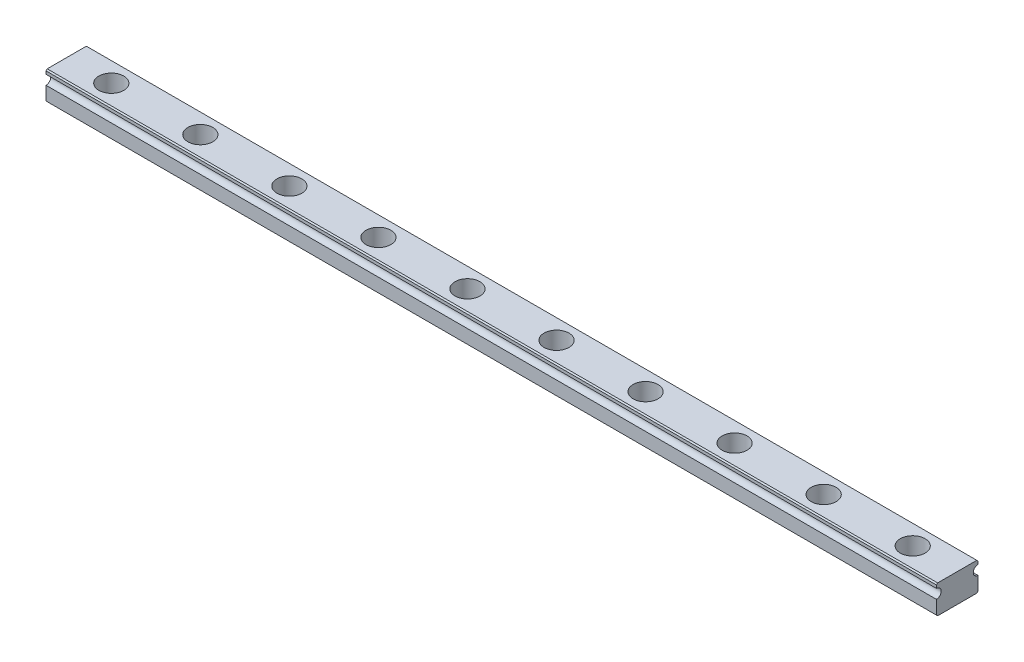
ISO-10303-21;
HEADER;
FILE_DESCRIPTION(('STEP AP214'),'2;1');
FILE_NAME('part.step','',(''),(''),'','','');
FILE_SCHEMA(('AUTOMOTIVE_DESIGN { 1 0 10303 214 1 1 1 1 }'));
ENDSEC;
DATA;
#1=APPLICATION_CONTEXT('core data for automotive mechanical design processes');
#2=APPLICATION_PROTOCOL_DEFINITION('international standard','automotive_design',2000,#1);
#3=PRODUCT_CONTEXT('',#1,'mechanical');
#4=PRODUCT('Part','Part','',(#3));
#5=PRODUCT_RELATED_PRODUCT_CATEGORY('part','',(#4));
#6=PRODUCT_DEFINITION_FORMATION('','',#4);
#7=PRODUCT_DEFINITION_CONTEXT('part definition',#1,'design');
#8=PRODUCT_DEFINITION('design','',#6,#7);
#9=PRODUCT_DEFINITION_SHAPE('','',#8);
#10=(LENGTH_UNIT() NAMED_UNIT(*) SI_UNIT(.MILLI.,.METRE.));
#11=(NAMED_UNIT(*) PLANE_ANGLE_UNIT() SI_UNIT($,.RADIAN.));
#12=(NAMED_UNIT(*) SI_UNIT($,.STERADIAN.) SOLID_ANGLE_UNIT());
#13=UNCERTAINTY_MEASURE_WITH_UNIT(LENGTH_MEASURE(1.E-05),#10,'distance_accuracy_value','');
#14=(GEOMETRIC_REPRESENTATION_CONTEXT(3) GLOBAL_UNCERTAINTY_ASSIGNED_CONTEXT((#13)) GLOBAL_UNIT_ASSIGNED_CONTEXT((#10,
#11,#12)) REPRESENTATION_CONTEXT('',''));
#15=CARTESIAN_POINT('',(0.,0.,0.));
#16=DIRECTION('',(0.,0.,1.));
#17=DIRECTION('',(1.,0.,0.));
#18=AXIS2_PLACEMENT_3D('',#15,#16,#17);
#19=CARTESIAN_POINT('',(75.,0.,-3.5));
#20=DIRECTION('',(0.,0.,1.));
#21=DIRECTION('',(1.,0.,0.));
#22=AXIS2_PLACEMENT_3D('',#19,#20,#21);
#23=PLANE('',#22);
#24=DIRECTION('',(0.,1.,0.));
#25=VECTOR('',#24,1.);
#26=CARTESIAN_POINT('',(75.,0.,-3.5));
#27=LINE('',#26,#25);
#28=CARTESIAN_POINT('',(75.,0.199999999999992,-3.5));
#29=VERTEX_POINT('',#28);
#30=CARTESIAN_POINT('',(75.,2.5,-3.5));
#31=VERTEX_POINT('',#30);
#32=EDGE_CURVE('E128',#29,#31,#27,.T.);
#33=ORIENTED_EDGE('',*,*,#32,.F.);
#34=DIRECTION('',(-1.,0.,0.));
#35=VECTOR('',#34,1.);
#36=CARTESIAN_POINT('',(75.,0.199999999999992,-3.5));
#37=LINE('',#36,#35);
#38=CARTESIAN_POINT('',(-75.,0.199999999999992,-3.5));
#39=VERTEX_POINT('',#38);
#40=EDGE_CURVE('E180',#29,#39,#37,.T.);
#41=ORIENTED_EDGE('',*,*,#40,.T.);
#42=DIRECTION('',(0.,1.,0.));
#43=VECTOR('',#42,1.);
#44=CARTESIAN_POINT('',(-75.,0.,-3.5));
#45=LINE('',#44,#43);
#46=CARTESIAN_POINT('',(-75.,2.5,-3.5));
#47=VERTEX_POINT('',#46);
#48=EDGE_CURVE('E152',#39,#47,#45,.T.);
#49=ORIENTED_EDGE('',*,*,#48,.T.);
#50=DIRECTION('',(-1.,0.,0.));
#51=VECTOR('',#50,1.);
#52=CARTESIAN_POINT('',(75.,2.5,-3.5));
#53=LINE('',#52,#51);
#54=EDGE_CURVE('E145',#31,#47,#53,.T.);
#55=ORIENTED_EDGE('',*,*,#54,.F.);
#56=EDGE_LOOP('',(#33,#41,#49,#55));
#57=FACE_BOUND('',#56,.T.);
#58=ADVANCED_FACE('F36',(#57),#23,.F.);
#59=CARTESIAN_POINT('',(75.,3.3,-3.5));
#60=DIRECTION('',(-1.,0.,0.));
#61=DIRECTION('',(0.,0.,1.));
#62=AXIS2_PLACEMENT_3D('',#59,#60,#61);
#63=CYLINDRICAL_SURFACE('',#62,0.8);
#64=CARTESIAN_POINT('',(-75.,3.3,-3.5));
#65=DIRECTION('',(-1.,0.,0.));
#66=DIRECTION('',(0.,0.,1.));
#67=AXIS2_PLACEMENT_3D('',#64,#65,#66);
#68=CIRCLE('',#67,0.8);
#69=CARTESIAN_POINT('',(-75.,4.1,-3.5));
#70=VERTEX_POINT('',#69);
#71=EDGE_CURVE('E218',#47,#70,#68,.T.);
#72=ORIENTED_EDGE('',*,*,#71,.T.);
#73=DIRECTION('',(-1.,0.,0.));
#74=VECTOR('',#73,1.);
#75=CARTESIAN_POINT('',(75.,4.1,-3.5));
#76=LINE('',#75,#74);
#77=CARTESIAN_POINT('',(75.,4.1,-3.5));
#78=VERTEX_POINT('',#77);
#79=EDGE_CURVE('E147',#78,#70,#76,.T.);
#80=ORIENTED_EDGE('',*,*,#79,.F.);
#81=CARTESIAN_POINT('',(75.,3.3,-3.5));
#82=DIRECTION('',(-1.,0.,0.));
#83=DIRECTION('',(0.,0.,1.));
#84=AXIS2_PLACEMENT_3D('',#81,#82,#83);
#85=CIRCLE('',#84,0.8);
#86=EDGE_CURVE('E132',#31,#78,#85,.T.);
#87=ORIENTED_EDGE('',*,*,#86,.F.);
#88=ORIENTED_EDGE('',*,*,#54,.T.);
#89=EDGE_LOOP('',(#72,#80,#87,#88));
#90=FACE_BOUND('',#89,.T.);
#91=ADVANCED_FACE('F144',(#90),#63,.F.);
#92=CARTESIAN_POINT('',(75.,4.1,-3.5));
#93=DIRECTION('',(0.,0.,1.));
#94=DIRECTION('',(1.,0.,0.));
#95=AXIS2_PLACEMENT_3D('',#92,#93,#94);
#96=PLANE('',#95);
#97=DIRECTION('',(0.,1.,0.));
#98=VECTOR('',#97,1.);
#99=CARTESIAN_POINT('',(-75.,4.1,-3.5));
#100=LINE('',#99,#98);
#101=CARTESIAN_POINT('',(-75.,4.60000000000001,-3.5));
#102=VERTEX_POINT('',#101);
#103=EDGE_CURVE('E220',#70,#102,#100,.T.);
#104=ORIENTED_EDGE('',*,*,#103,.T.);
#105=DIRECTION('',(1.,0.,0.));
#106=VECTOR('',#105,1.);
#107=CARTESIAN_POINT('',(75.,4.60000000000001,-3.5));
#108=LINE('',#107,#106);
#109=CARTESIAN_POINT('',(75.,4.60000000000001,-3.5));
#110=VERTEX_POINT('',#109);
#111=EDGE_CURVE('E172',#102,#110,#108,.T.);
#112=ORIENTED_EDGE('',*,*,#111,.T.);
#113=DIRECTION('',(0.,1.,0.));
#114=VECTOR('',#113,1.);
#115=CARTESIAN_POINT('',(75.,4.1,-3.5));
#116=LINE('',#115,#114);
#117=EDGE_CURVE('E149',#78,#110,#116,.T.);
#118=ORIENTED_EDGE('',*,*,#117,.F.);
#119=ORIENTED_EDGE('',*,*,#79,.T.);
#120=EDGE_LOOP('',(#104,#112,#118,#119));
#121=FACE_BOUND('',#120,.T.);
#122=ADVANCED_FACE('F282',(#121),#96,.F.);
#123=CARTESIAN_POINT('',(75.,4.8,-3.5));
#124=DIRECTION('',(0.,-1.,0.));
#125=DIRECTION('',(0.,0.,-1.));
#126=AXIS2_PLACEMENT_3D('',#123,#124,#125);
#127=PLANE('',#126);
#128=CARTESIAN_POINT('',(-67.5,4.8,1.24498369098229E-12));
#129=DIRECTION('',(0.,1.,0.));
#130=DIRECTION('',(0.,0.,1.));
#131=AXIS2_PLACEMENT_3D('',#128,#129,#130);
#132=CIRCLE('',#131,2.10000000000002);
#133=CARTESIAN_POINT('',(-67.5,4.8,2.10000000000126));
#134=VERTEX_POINT('',#133);
#135=EDGE_CURVE('E375',#134,#134,#132,.T.);
#136=ORIENTED_EDGE('',*,*,#135,.F.);
#137=EDGE_LOOP('',(#136));
#138=FACE_BOUND('',#137,.T.);
#139=CARTESIAN_POINT('',(52.5,4.8,9.33737768236719E-13));
#140=DIRECTION('',(0.,1.,0.));
#141=DIRECTION('',(0.,0.,-1.));
#142=AXIS2_PLACEMENT_3D('',#139,#140,#141);
#143=CIRCLE('',#142,2.1);
#144=CARTESIAN_POINT('',(52.5,4.8,-2.09999999999907));
#145=VERTEX_POINT('',#144);
#146=EDGE_CURVE('E373',#145,#145,#143,.T.);
#147=ORIENTED_EDGE('',*,*,#146,.F.);
#148=EDGE_LOOP('',(#147));
#149=FACE_BOUND('',#148,.T.);
#150=CARTESIAN_POINT('',(37.5,4.8,6.22491845491146E-13));
#151=DIRECTION('',(0.,1.,0.));
#152=DIRECTION('',(0.,0.,-1.));
#153=AXIS2_PLACEMENT_3D('',#150,#151,#152);
#154=CIRCLE('',#153,2.1);
#155=CARTESIAN_POINT('',(37.5,4.8,-2.09999999999937));
#156=VERTEX_POINT('',#155);
#157=EDGE_CURVE('E369',#156,#156,#154,.T.);
#158=ORIENTED_EDGE('',*,*,#157,.F.);
#159=EDGE_LOOP('',(#158));
#160=FACE_BOUND('',#159,.T.);
#161=CARTESIAN_POINT('',(22.5,4.8,3.11245922745573E-13));
#162=DIRECTION('',(0.,1.,0.));
#163=DIRECTION('',(0.,0.,-1.));
#164=AXIS2_PLACEMENT_3D('',#161,#162,#163);
#165=CIRCLE('',#164,2.1);
#166=CARTESIAN_POINT('',(22.5,4.8,-2.09999999999969));
#167=VERTEX_POINT('',#166);
#168=EDGE_CURVE('E366',#167,#167,#165,.T.);
#169=ORIENTED_EDGE('',*,*,#168,.F.);
#170=EDGE_LOOP('',(#169));
#171=FACE_BOUND('',#170,.T.);
#172=CARTESIAN_POINT('',(-52.5,4.8,9.33737768236719E-13));
#173=DIRECTION('',(0.,1.,0.));
#174=DIRECTION('',(0.,0.,1.));
#175=AXIS2_PLACEMENT_3D('',#172,#173,#174);
#176=CIRCLE('',#175,2.1);
#177=CARTESIAN_POINT('',(-52.5,4.8,2.10000000000094));
#178=VERTEX_POINT('',#177);
#179=EDGE_CURVE('E378',#178,#178,#176,.T.);
#180=ORIENTED_EDGE('',*,*,#179,.F.);
#181=EDGE_LOOP('',(#180));
#182=FACE_BOUND('',#181,.T.);
#183=CARTESIAN_POINT('',(-37.5,4.8,6.22491845491146E-13));
#184=DIRECTION('',(0.,1.,0.));
#185=DIRECTION('',(0.,0.,1.));
#186=AXIS2_PLACEMENT_3D('',#183,#184,#185);
#187=CIRCLE('',#186,2.1);
#188=CARTESIAN_POINT('',(-37.5,4.8,2.10000000000062));
#189=VERTEX_POINT('',#188);
#190=EDGE_CURVE('E387',#189,#189,#187,.T.);
#191=ORIENTED_EDGE('',*,*,#190,.F.);
#192=EDGE_LOOP('',(#191));
#193=FACE_BOUND('',#192,.T.);
#194=CARTESIAN_POINT('',(-22.5,4.8,3.11245922745573E-13));
#195=DIRECTION('',(0.,1.,0.));
#196=DIRECTION('',(0.,0.,1.));
#197=AXIS2_PLACEMENT_3D('',#194,#195,#196);
#198=CIRCLE('',#197,2.1);
#199=CARTESIAN_POINT('',(-22.5,4.8,2.10000000000031));
#200=VERTEX_POINT('',#199);
#201=EDGE_CURVE('E384',#200,#200,#198,.T.);
#202=ORIENTED_EDGE('',*,*,#201,.F.);
#203=EDGE_LOOP('',(#202));
#204=FACE_BOUND('',#203,.T.);
#205=CARTESIAN_POINT('',(67.5,4.8,1.24498369098229E-12));
#206=DIRECTION('',(0.,1.,0.));
#207=DIRECTION('',(0.,0.,-1.));
#208=AXIS2_PLACEMENT_3D('',#205,#206,#207);
#209=CIRCLE('',#208,2.10000000000002);
#210=CARTESIAN_POINT('',(67.5,4.8,-2.09999999999877));
#211=VERTEX_POINT('',#210);
#212=EDGE_CURVE('E381',#211,#211,#209,.T.);
#213=ORIENTED_EDGE('',*,*,#212,.F.);
#214=EDGE_LOOP('',(#213));
#215=FACE_BOUND('',#214,.T.);
#216=CARTESIAN_POINT('',(7.5,4.8,0.));
#217=DIRECTION('',(0.,1.,0.));
#218=DIRECTION('',(0.,0.,-1.));
#219=AXIS2_PLACEMENT_3D('',#216,#217,#218);
#220=CIRCLE('',#219,2.1);
#221=CARTESIAN_POINT('',(7.5,4.8,-2.1));
#222=VERTEX_POINT('',#221);
#223=EDGE_CURVE('E359',#222,#222,#220,.T.);
#224=ORIENTED_EDGE('',*,*,#223,.F.);
#225=EDGE_LOOP('',(#224));
#226=FACE_BOUND('',#225,.T.);
#227=CARTESIAN_POINT('',(-7.5,4.8,0.));
#228=DIRECTION('',(0.,1.,0.));
#229=DIRECTION('',(0.,0.,1.));
#230=AXIS2_PLACEMENT_3D('',#227,#228,#229);
#231=CIRCLE('',#230,2.1);
#232=CARTESIAN_POINT('',(-7.5,4.8,2.1));
#233=VERTEX_POINT('',#232);
#234=EDGE_CURVE('E191',#233,#233,#231,.T.);
#235=ORIENTED_EDGE('',*,*,#234,.F.);
#236=EDGE_LOOP('',(#235));
#237=FACE_BOUND('',#236,.T.);
#238=DIRECTION('',(0.,0.,1.));
#239=VECTOR('',#238,1.);
#240=CARTESIAN_POINT('',(75.,4.8,-3.5));
#241=LINE('',#240,#239);
#242=CARTESIAN_POINT('',(75.,4.8,-3.30000000000001));
#243=VERTEX_POINT('',#242);
#244=CARTESIAN_POINT('',(75.,4.8,3.29999999999999));
#245=VERTEX_POINT('',#244);
#246=EDGE_CURVE('E395',#243,#245,#241,.T.);
#247=ORIENTED_EDGE('',*,*,#246,.F.);
#248=DIRECTION('',(-1.,0.,0.));
#249=VECTOR('',#248,1.);
#250=CARTESIAN_POINT('',(75.,4.8,-3.30000000000001));
#251=LINE('',#250,#249);
#252=CARTESIAN_POINT('',(-75.,4.8,-3.30000000000001));
#253=VERTEX_POINT('',#252);
#254=EDGE_CURVE('E156',#243,#253,#251,.T.);
#255=ORIENTED_EDGE('',*,*,#254,.T.);
#256=DIRECTION('',(0.,0.,1.));
#257=VECTOR('',#256,1.);
#258=CARTESIAN_POINT('',(-75.,4.8,-3.5));
#259=LINE('',#258,#257);
#260=CARTESIAN_POINT('',(-75.,4.8,3.29999999999999));
#261=VERTEX_POINT('',#260);
#262=EDGE_CURVE('E228',#253,#261,#259,.T.);
#263=ORIENTED_EDGE('',*,*,#262,.T.);
#264=DIRECTION('',(1.,0.,0.));
#265=VECTOR('',#264,1.);
#266=CARTESIAN_POINT('',(75.,4.8,3.29999999999999));
#267=LINE('',#266,#265);
#268=EDGE_CURVE('E154',#261,#245,#267,.T.);
#269=ORIENTED_EDGE('',*,*,#268,.T.);
#270=EDGE_LOOP('',(#247,#255,#263,#269));
#271=FACE_BOUND('',#270,.T.);
#272=ADVANCED_FACE('F297',(#138,#149,#160,#171,#182,#193,#204,#215,#226,#237,#271),#127,.F.);
#273=CARTESIAN_POINT('',(75.,4.1,3.5));
#274=DIRECTION('',(0.,0.,-1.));
#275=DIRECTION('',(-1.,0.,0.));
#276=AXIS2_PLACEMENT_3D('',#273,#274,#275);
#277=PLANE('',#276);
#278=DIRECTION('',(0.,-1.,0.));
#279=VECTOR('',#278,1.);
#280=CARTESIAN_POINT('',(75.,4.1,3.5));
#281=LINE('',#280,#279);
#282=CARTESIAN_POINT('',(75.,4.59999999999999,3.5));
#283=VERTEX_POINT('',#282);
#284=CARTESIAN_POINT('',(75.,4.1,3.5));
#285=VERTEX_POINT('',#284);
#286=EDGE_CURVE('E398',#283,#285,#281,.T.);
#287=ORIENTED_EDGE('',*,*,#286,.F.);
#288=DIRECTION('',(-1.,0.,0.));
#289=VECTOR('',#288,1.);
#290=CARTESIAN_POINT('',(75.,4.59999999999999,3.5));
#291=LINE('',#290,#289);
#292=CARTESIAN_POINT('',(-75.,4.59999999999999,3.5));
#293=VERTEX_POINT('',#292);
#294=EDGE_CURVE('E11',#283,#293,#291,.T.);
#295=ORIENTED_EDGE('',*,*,#294,.T.);
#296=DIRECTION('',(0.,-1.,0.));
#297=VECTOR('',#296,1.);
#298=CARTESIAN_POINT('',(-75.,4.1,3.5));
#299=LINE('',#298,#297);
#300=CARTESIAN_POINT('',(-75.,4.1,3.5));
#301=VERTEX_POINT('',#300);
#302=EDGE_CURVE('E231',#293,#301,#299,.T.);
#303=ORIENTED_EDGE('',*,*,#302,.T.);
#304=DIRECTION('',(-1.,0.,0.));
#305=VECTOR('',#304,1.);
#306=CARTESIAN_POINT('',(75.,4.1,3.5));
#307=LINE('',#306,#305);
#308=EDGE_CURVE('E158',#285,#301,#307,.T.);
#309=ORIENTED_EDGE('',*,*,#308,.F.);
#310=EDGE_LOOP('',(#287,#295,#303,#309));
#311=FACE_BOUND('',#310,.T.);
#312=ADVANCED_FACE('F301',(#311),#277,.F.);
#313=CARTESIAN_POINT('',(75.,3.3,3.5));
#314=DIRECTION('',(-1.,0.,0.));
#315=DIRECTION('',(0.,0.,1.));
#316=AXIS2_PLACEMENT_3D('',#313,#314,#315);
#317=CYLINDRICAL_SURFACE('',#316,0.8);
#318=CARTESIAN_POINT('',(-75.,3.3,3.5));
#319=DIRECTION('',(-1.,0.,0.));
#320=DIRECTION('',(0.,0.,-1.));
#321=AXIS2_PLACEMENT_3D('',#318,#319,#320);
#322=CIRCLE('',#321,0.8);
#323=CARTESIAN_POINT('',(-75.,2.5,3.5));
#324=VERTEX_POINT('',#323);
#325=EDGE_CURVE('E233',#301,#324,#322,.T.);
#326=ORIENTED_EDGE('',*,*,#325,.T.);
#327=DIRECTION('',(-1.,0.,0.));
#328=VECTOR('',#327,1.);
#329=CARTESIAN_POINT('',(75.,2.5,3.5));
#330=LINE('',#329,#328);
#331=CARTESIAN_POINT('',(75.,2.5,3.5));
#332=VERTEX_POINT('',#331);
#333=EDGE_CURVE('E239',#332,#324,#330,.T.);
#334=ORIENTED_EDGE('',*,*,#333,.F.);
#335=CARTESIAN_POINT('',(75.,3.3,3.5));
#336=DIRECTION('',(-1.,0.,0.));
#337=DIRECTION('',(0.,0.,-1.));
#338=AXIS2_PLACEMENT_3D('',#335,#336,#337);
#339=CIRCLE('',#338,0.8);
#340=EDGE_CURVE('E248',#285,#332,#339,.T.);
#341=ORIENTED_EDGE('',*,*,#340,.F.);
#342=ORIENTED_EDGE('',*,*,#308,.T.);
#343=EDGE_LOOP('',(#326,#334,#341,#342));
#344=FACE_BOUND('',#343,.T.);
#345=ADVANCED_FACE('F246',(#344),#317,.F.);
#346=CARTESIAN_POINT('',(75.,0.,3.5));
#347=DIRECTION('',(0.,0.,-1.));
#348=DIRECTION('',(-1.,0.,0.));
#349=AXIS2_PLACEMENT_3D('',#346,#347,#348);
#350=PLANE('',#349);
#351=DIRECTION('',(0.,-1.,0.));
#352=VECTOR('',#351,1.);
#353=CARTESIAN_POINT('',(-75.,0.,3.5));
#354=LINE('',#353,#352);
#355=CARTESIAN_POINT('',(-75.,0.200000000000006,3.5));
#356=VERTEX_POINT('',#355);
#357=EDGE_CURVE('E235',#324,#356,#354,.T.);
#358=ORIENTED_EDGE('',*,*,#357,.T.);
#359=DIRECTION('',(1.,0.,0.));
#360=VECTOR('',#359,1.);
#361=CARTESIAN_POINT('',(75.,0.200000000000006,3.5));
#362=LINE('',#361,#360);
#363=CARTESIAN_POINT('',(75.,0.200000000000006,3.5));
#364=VERTEX_POINT('',#363);
#365=EDGE_CURVE('E46',#356,#364,#362,.T.);
#366=ORIENTED_EDGE('',*,*,#365,.T.);
#367=DIRECTION('',(0.,-1.,0.));
#368=VECTOR('',#367,1.);
#369=CARTESIAN_POINT('',(75.,0.,3.5));
#370=LINE('',#369,#368);
#371=EDGE_CURVE('E400',#332,#364,#370,.T.);
#372=ORIENTED_EDGE('',*,*,#371,.F.);
#373=ORIENTED_EDGE('',*,*,#333,.T.);
#374=EDGE_LOOP('',(#358,#366,#372,#373));
#375=FACE_BOUND('',#374,.T.);
#376=ADVANCED_FACE('F259',(#375),#350,.F.);
#377=CARTESIAN_POINT('',(75.,0.,3.5));
#378=DIRECTION('',(0.,1.,0.));
#379=DIRECTION('',(0.,0.,1.));
#380=AXIS2_PLACEMENT_3D('',#377,#378,#379);
#381=PLANE('',#380);
#382=CARTESIAN_POINT('',(-67.5,0.,1.24498369098229E-12));
#383=DIRECTION('',(0.,1.,0.));
#384=DIRECTION('',(0.,0.,1.));
#385=AXIS2_PLACEMENT_3D('',#382,#383,#384);
#386=CIRCLE('',#385,2.10000000000002);
#387=CARTESIAN_POINT('',(-67.5,0.,2.10000000000126));
#388=VERTEX_POINT('',#387);
#389=EDGE_CURVE('E41',#388,#388,#386,.T.);
#390=ORIENTED_EDGE('',*,*,#389,.T.);
#391=EDGE_LOOP('',(#390));
#392=FACE_BOUND('',#391,.T.);
#393=CARTESIAN_POINT('',(52.5,0.,9.33737768236719E-13));
#394=DIRECTION('',(0.,1.,0.));
#395=DIRECTION('',(0.,0.,1.));
#396=AXIS2_PLACEMENT_3D('',#393,#394,#395);
#397=CIRCLE('',#396,2.1);
#398=CARTESIAN_POINT('',(52.5,0.,2.10000000000094));
#399=VERTEX_POINT('',#398);
#400=EDGE_CURVE('E211',#399,#399,#397,.T.);
#401=ORIENTED_EDGE('',*,*,#400,.T.);
#402=EDGE_LOOP('',(#401));
#403=FACE_BOUND('',#402,.T.);
#404=CARTESIAN_POINT('',(37.5,0.,6.22491845491146E-13));
#405=DIRECTION('',(0.,1.,0.));
#406=DIRECTION('',(0.,0.,1.));
#407=AXIS2_PLACEMENT_3D('',#404,#405,#406);
#408=CIRCLE('',#407,2.1);
#409=CARTESIAN_POINT('',(37.5,0.,2.10000000000062));
#410=VERTEX_POINT('',#409);
#411=EDGE_CURVE('E209',#410,#410,#408,.T.);
#412=ORIENTED_EDGE('',*,*,#411,.T.);
#413=EDGE_LOOP('',(#412));
#414=FACE_BOUND('',#413,.T.);
#415=CARTESIAN_POINT('',(22.5,0.,3.11245922745573E-13));
#416=DIRECTION('',(0.,1.,0.));
#417=DIRECTION('',(0.,0.,1.));
#418=AXIS2_PLACEMENT_3D('',#415,#416,#417);
#419=CIRCLE('',#418,2.1);
#420=CARTESIAN_POINT('',(22.5,0.,2.10000000000031));
#421=VERTEX_POINT('',#420);
#422=EDGE_CURVE('E206',#421,#421,#419,.T.);
#423=ORIENTED_EDGE('',*,*,#422,.T.);
#424=EDGE_LOOP('',(#423));
#425=FACE_BOUND('',#424,.T.);
#426=CARTESIAN_POINT('',(-52.5,0.,9.33737768236719E-13));
#427=DIRECTION('',(0.,1.,0.));
#428=DIRECTION('',(0.,0.,1.));
#429=AXIS2_PLACEMENT_3D('',#426,#427,#428);
#430=CIRCLE('',#429,2.1);
#431=CARTESIAN_POINT('',(-52.5,0.,2.10000000000094));
#432=VERTEX_POINT('',#431);
#433=EDGE_CURVE('E203',#432,#432,#430,.T.);
#434=ORIENTED_EDGE('',*,*,#433,.T.);
#435=EDGE_LOOP('',(#434));
#436=FACE_BOUND('',#435,.T.);
#437=CARTESIAN_POINT('',(-37.5,0.,6.22491845491146E-13));
#438=DIRECTION('',(0.,1.,0.));
#439=DIRECTION('',(0.,0.,1.));
#440=AXIS2_PLACEMENT_3D('',#437,#438,#439);
#441=CIRCLE('',#440,2.1);
#442=CARTESIAN_POINT('',(-37.5,0.,2.10000000000062));
#443=VERTEX_POINT('',#442);
#444=EDGE_CURVE('E200',#443,#443,#441,.T.);
#445=ORIENTED_EDGE('',*,*,#444,.T.);
#446=EDGE_LOOP('',(#445));
#447=FACE_BOUND('',#446,.T.);
#448=CARTESIAN_POINT('',(-22.5,0.,3.11245922745573E-13));
#449=DIRECTION('',(0.,1.,0.));
#450=DIRECTION('',(0.,0.,1.));
#451=AXIS2_PLACEMENT_3D('',#448,#449,#450);
#452=CIRCLE('',#451,2.1);
#453=CARTESIAN_POINT('',(-22.5,0.,2.10000000000031));
#454=VERTEX_POINT('',#453);
#455=EDGE_CURVE('E197',#454,#454,#452,.T.);
#456=ORIENTED_EDGE('',*,*,#455,.T.);
#457=EDGE_LOOP('',(#456));
#458=FACE_BOUND('',#457,.T.);
#459=CARTESIAN_POINT('',(67.5,0.,1.24498369098229E-12));
#460=DIRECTION('',(0.,1.,0.));
#461=DIRECTION('',(0.,0.,1.));
#462=AXIS2_PLACEMENT_3D('',#459,#460,#461);
#463=CIRCLE('',#462,2.10000000000002);
#464=CARTESIAN_POINT('',(67.5,0.,2.10000000000126));
#465=VERTEX_POINT('',#464);
#466=EDGE_CURVE('E194',#465,#465,#463,.T.);
#467=ORIENTED_EDGE('',*,*,#466,.T.);
#468=EDGE_LOOP('',(#467));
#469=FACE_BOUND('',#468,.T.);
#470=CARTESIAN_POINT('',(7.5,0.,0.));
#471=DIRECTION('',(0.,1.,0.));
#472=DIRECTION('',(0.,0.,1.));
#473=AXIS2_PLACEMENT_3D('',#470,#471,#472);
#474=CIRCLE('',#473,2.1);
#475=CARTESIAN_POINT('',(7.5,0.,2.1));
#476=VERTEX_POINT('',#475);
#477=EDGE_CURVE('E190',#476,#476,#474,.T.);
#478=ORIENTED_EDGE('',*,*,#477,.T.);
#479=EDGE_LOOP('',(#478));
#480=FACE_BOUND('',#479,.T.);
#481=CARTESIAN_POINT('',(-7.5,0.,0.));
#482=DIRECTION('',(0.,1.,0.));
#483=DIRECTION('',(0.,0.,1.));
#484=AXIS2_PLACEMENT_3D('',#481,#482,#483);
#485=CIRCLE('',#484,2.1);
#486=CARTESIAN_POINT('',(-7.5,0.,2.1));
#487=VERTEX_POINT('',#486);
#488=EDGE_CURVE('E187',#487,#487,#485,.T.);
#489=ORIENTED_EDGE('',*,*,#488,.T.);
#490=EDGE_LOOP('',(#489));
#491=FACE_BOUND('',#490,.T.);
#492=DIRECTION('',(0.,0.,-1.));
#493=VECTOR('',#492,1.);
#494=CARTESIAN_POINT('',(-75.,0.,3.5));
#495=LINE('',#494,#493);
#496=CARTESIAN_POINT('',(-75.,0.,3.29999999999999));
#497=VERTEX_POINT('',#496);
#498=CARTESIAN_POINT('',(-75.,0.,-3.29999999999999));
#499=VERTEX_POINT('',#498);
#500=EDGE_CURVE('E140',#497,#499,#495,.T.);
#501=ORIENTED_EDGE('',*,*,#500,.T.);
#502=DIRECTION('',(1.,0.,0.));
#503=VECTOR('',#502,1.);
#504=CARTESIAN_POINT('',(75.,0.,-3.29999999999999));
#505=LINE('',#504,#503);
#506=CARTESIAN_POINT('',(75.,0.,-3.29999999999999));
#507=VERTEX_POINT('',#506);
#508=EDGE_CURVE('E54',#499,#507,#505,.T.);
#509=ORIENTED_EDGE('',*,*,#508,.T.);
#510=DIRECTION('',(0.,0.,-1.));
#511=VECTOR('',#510,1.);
#512=CARTESIAN_POINT('',(75.,0.,3.5));
#513=LINE('',#512,#511);
#514=CARTESIAN_POINT('',(75.,0.,3.29999999999999));
#515=VERTEX_POINT('',#514);
#516=EDGE_CURVE('E223',#515,#507,#513,.T.);
#517=ORIENTED_EDGE('',*,*,#516,.F.);
#518=DIRECTION('',(-1.,0.,0.));
#519=VECTOR('',#518,1.);
#520=CARTESIAN_POINT('',(75.,0.,3.29999999999999));
#521=LINE('',#520,#519);
#522=EDGE_CURVE('E182',#515,#497,#521,.T.);
#523=ORIENTED_EDGE('',*,*,#522,.T.);
#524=EDGE_LOOP('',(#501,#509,#517,#523));
#525=FACE_BOUND('',#524,.T.);
#526=ADVANCED_FACE('F264',(#392,#403,#414,#425,#436,#447,#458,#469,#480,#491,#525),#381,.F.);
#527=CARTESIAN_POINT('',(75.,3.3,-3.5));
#528=DIRECTION('',(-1.,0.,0.));
#529=DIRECTION('',(0.,0.,1.));
#530=AXIS2_PLACEMENT_3D('',#527,#528,#529);
#531=PLANE('',#530);
#532=ORIENTED_EDGE('',*,*,#117,.T.);
#533=DIRECTION('',(0.,-0.707106781186548,-0.707106781186548));
#534=VECTOR('',#533,1.);
#535=CARTESIAN_POINT('',(75.,4.8,-3.30000000000001));
#536=LINE('',#535,#534);
#537=EDGE_CURVE('E178',#110,#243,#536,.F.);
#538=ORIENTED_EDGE('',*,*,#537,.T.);
#539=ORIENTED_EDGE('',*,*,#246,.T.);
#540=DIRECTION('',(0.,0.707106781186548,-0.707106781186548));
#541=VECTOR('',#540,1.);
#542=CARTESIAN_POINT('',(75.,4.59999999999999,3.5));
#543=LINE('',#542,#541);
#544=EDGE_CURVE('E174',#245,#283,#543,.F.);
#545=ORIENTED_EDGE('',*,*,#544,.T.);
#546=ORIENTED_EDGE('',*,*,#286,.T.);
#547=ORIENTED_EDGE('',*,*,#340,.T.);
#548=ORIENTED_EDGE('',*,*,#371,.T.);
#549=DIRECTION('',(0.,0.707106781186548,0.707106781186548));
#550=VECTOR('',#549,1.);
#551=CARTESIAN_POINT('',(75.,0.,3.29999999999999));
#552=LINE('',#551,#550);
#553=EDGE_CURVE('E61',#364,#515,#552,.F.);
#554=ORIENTED_EDGE('',*,*,#553,.T.);
#555=ORIENTED_EDGE('',*,*,#516,.T.);
#556=DIRECTION('',(0.,-0.707106781186523,0.707106781186572));
#557=VECTOR('',#556,1.);
#558=CARTESIAN_POINT('',(75.,0.199999999999992,-3.5));
#559=LINE('',#558,#557);
#560=EDGE_CURVE('E135',#507,#29,#559,.F.);
#561=ORIENTED_EDGE('',*,*,#560,.T.);
#562=ORIENTED_EDGE('',*,*,#32,.T.);
#563=ORIENTED_EDGE('',*,*,#86,.T.);
#564=EDGE_LOOP('',(#532,#538,#539,#545,#546,#547,#548,#554,#555,#561,#562,#563));
#565=FACE_BOUND('',#564,.T.);
#566=ADVANCED_FACE('F131',(#565),#531,.F.);
#567=CARTESIAN_POINT('',(-75.,3.3,-3.5));
#568=DIRECTION('',(-1.,0.,0.));
#569=DIRECTION('',(0.,0.,1.));
#570=AXIS2_PLACEMENT_3D('',#567,#568,#569);
#571=PLANE('',#570);
#572=ORIENTED_EDGE('',*,*,#262,.F.);
#573=DIRECTION('',(0.,0.707106781186548,0.707106781186548));
#574=VECTOR('',#573,1.);
#575=CARTESIAN_POINT('',(-75.,3.95,-4.15));
#576=LINE('',#575,#574);
#577=EDGE_CURVE('E170',#253,#102,#576,.F.);
#578=ORIENTED_EDGE('',*,*,#577,.T.);
#579=ORIENTED_EDGE('',*,*,#103,.F.);
#580=ORIENTED_EDGE('',*,*,#71,.F.);
#581=ORIENTED_EDGE('',*,*,#48,.F.);
#582=DIRECTION('',(0.,0.707106781186523,-0.707106781186572));
#583=VECTOR('',#582,1.);
#584=CARTESIAN_POINT('',(-75.,1.74999999999989,-5.05000000000001));
#585=LINE('',#584,#583);
#586=EDGE_CURVE('E168',#39,#499,#585,.F.);
#587=ORIENTED_EDGE('',*,*,#586,.T.);
#588=ORIENTED_EDGE('',*,*,#500,.F.);
#589=DIRECTION('',(0.,-0.707106781186548,-0.707106781186548));
#590=VECTOR('',#589,1.);
#591=CARTESIAN_POINT('',(-75.,-1.75,1.55));
#592=LINE('',#591,#590);
#593=EDGE_CURVE('E166',#497,#356,#592,.F.);
#594=ORIENTED_EDGE('',*,*,#593,.T.);
#595=ORIENTED_EDGE('',*,*,#357,.F.);
#596=ORIENTED_EDGE('',*,*,#325,.F.);
#597=ORIENTED_EDGE('',*,*,#302,.F.);
#598=DIRECTION('',(0.,-0.707106781186548,0.707106781186548));
#599=VECTOR('',#598,1.);
#600=CARTESIAN_POINT('',(-75.,7.45,0.649999999999996));
#601=LINE('',#600,#599);
#602=EDGE_CURVE('E164',#293,#261,#601,.F.);
#603=ORIENTED_EDGE('',*,*,#602,.T.);
#604=EDGE_LOOP('',(#572,#578,#579,#580,#581,#587,#588,#594,#595,#596,#597,#603));
#605=FACE_BOUND('',#604,.T.);
#606=ADVANCED_FACE('F255',(#605),#571,.T.);
#607=CARTESIAN_POINT('',(75.,4.8,-3.30000000000001));
#608=DIRECTION('',(0.,-0.707106781186548,0.707106781186548));
#609=DIRECTION('',(-1.,0.,0.));
#610=AXIS2_PLACEMENT_3D('',#607,#608,#609);
#611=PLANE('',#610);
#612=ORIENTED_EDGE('',*,*,#537,.F.);
#613=ORIENTED_EDGE('',*,*,#111,.F.);
#614=ORIENTED_EDGE('',*,*,#577,.F.);
#615=ORIENTED_EDGE('',*,*,#254,.F.);
#616=EDGE_LOOP('',(#612,#613,#614,#615));
#617=FACE_BOUND('',#616,.T.);
#618=ADVANCED_FACE('F268',(#617),#611,.F.);
#619=CARTESIAN_POINT('',(75.,0.199999999999992,-3.5));
#620=DIRECTION('',(0.,0.707106781186572,0.707106781186523));
#621=DIRECTION('',(-1.,0.,0.));
#622=AXIS2_PLACEMENT_3D('',#619,#620,#621);
#623=PLANE('',#622);
#624=ORIENTED_EDGE('',*,*,#560,.F.);
#625=ORIENTED_EDGE('',*,*,#508,.F.);
#626=ORIENTED_EDGE('',*,*,#586,.F.);
#627=ORIENTED_EDGE('',*,*,#40,.F.);
#628=EDGE_LOOP('',(#624,#625,#626,#627));
#629=FACE_BOUND('',#628,.T.);
#630=ADVANCED_FACE('F266',(#629),#623,.F.);
#631=CARTESIAN_POINT('',(75.,0.,3.29999999999999));
#632=DIRECTION('',(0.,0.707106781186548,-0.707106781186548));
#633=DIRECTION('',(-1.,0.,0.));
#634=AXIS2_PLACEMENT_3D('',#631,#632,#633);
#635=PLANE('',#634);
#636=ORIENTED_EDGE('',*,*,#553,.F.);
#637=ORIENTED_EDGE('',*,*,#365,.F.);
#638=ORIENTED_EDGE('',*,*,#593,.F.);
#639=ORIENTED_EDGE('',*,*,#522,.F.);
#640=EDGE_LOOP('',(#636,#637,#638,#639));
#641=FACE_BOUND('',#640,.T.);
#642=ADVANCED_FACE('F262',(#641),#635,.F.);
#643=CARTESIAN_POINT('',(75.,4.59999999999999,3.5));
#644=DIRECTION('',(0.,-0.707106781186548,-0.707106781186548));
#645=DIRECTION('',(-1.,0.,0.));
#646=AXIS2_PLACEMENT_3D('',#643,#644,#645);
#647=PLANE('',#646);
#648=ORIENTED_EDGE('',*,*,#544,.F.);
#649=ORIENTED_EDGE('',*,*,#268,.F.);
#650=ORIENTED_EDGE('',*,*,#602,.F.);
#651=ORIENTED_EDGE('',*,*,#294,.F.);
#652=EDGE_LOOP('',(#648,#649,#650,#651));
#653=FACE_BOUND('',#652,.T.);
#654=ADVANCED_FACE('F39',(#653),#647,.F.);
#655=CARTESIAN_POINT('',(-7.5,-145.2,0.));
#656=DIRECTION('',(0.,1.,0.));
#657=DIRECTION('',(0.,0.,1.));
#658=AXIS2_PLACEMENT_3D('',#655,#656,#657);
#659=CYLINDRICAL_SURFACE('',#658,2.1);
#660=ORIENTED_EDGE('',*,*,#234,.T.);
#661=EDGE_LOOP('',(#660));
#662=FACE_BOUND('',#661,.T.);
#663=ORIENTED_EDGE('',*,*,#488,.F.);
#664=EDGE_LOOP('',(#663));
#665=FACE_BOUND('',#664,.T.);
#666=ADVANCED_FACE('F315',(#662,#665),#659,.F.);
#667=CARTESIAN_POINT('',(7.5,-145.2,0.));
#668=DIRECTION('',(0.,1.,0.));
#669=DIRECTION('',(0.,0.,1.));
#670=AXIS2_PLACEMENT_3D('',#667,#668,#669);
#671=CYLINDRICAL_SURFACE('',#670,2.1);
#672=ORIENTED_EDGE('',*,*,#223,.T.);
#673=EDGE_LOOP('',(#672));
#674=FACE_BOUND('',#673,.T.);
#675=ORIENTED_EDGE('',*,*,#477,.F.);
#676=EDGE_LOOP('',(#675));
#677=FACE_BOUND('',#676,.T.);
#678=ADVANCED_FACE('F318',(#674,#677),#671,.F.);
#679=CARTESIAN_POINT('',(67.5,-145.2,1.24498369098229E-12));
#680=DIRECTION('',(0.,1.,0.));
#681=DIRECTION('',(0.,0.,1.));
#682=AXIS2_PLACEMENT_3D('',#679,#680,#681);
#683=CYLINDRICAL_SURFACE('',#682,2.10000000000002);
#684=ORIENTED_EDGE('',*,*,#212,.T.);
#685=EDGE_LOOP('',(#684));
#686=FACE_BOUND('',#685,.T.);
#687=ORIENTED_EDGE('',*,*,#466,.F.);
#688=EDGE_LOOP('',(#687));
#689=FACE_BOUND('',#688,.T.);
#690=ADVANCED_FACE('F332',(#686,#689),#683,.F.);
#691=CARTESIAN_POINT('',(-22.5,-145.2,3.11245922745573E-13));
#692=DIRECTION('',(0.,1.,0.));
#693=DIRECTION('',(0.,0.,1.));
#694=AXIS2_PLACEMENT_3D('',#691,#692,#693);
#695=CYLINDRICAL_SURFACE('',#694,2.1);
#696=ORIENTED_EDGE('',*,*,#201,.T.);
#697=EDGE_LOOP('',(#696));
#698=FACE_BOUND('',#697,.T.);
#699=ORIENTED_EDGE('',*,*,#455,.F.);
#700=EDGE_LOOP('',(#699));
#701=FACE_BOUND('',#700,.T.);
#702=ADVANCED_FACE('F328',(#698,#701),#695,.F.);
#703=CARTESIAN_POINT('',(-37.5,-145.2,6.22491845491146E-13));
#704=DIRECTION('',(0.,1.,0.));
#705=DIRECTION('',(0.,0.,1.));
#706=AXIS2_PLACEMENT_3D('',#703,#704,#705);
#707=CYLINDRICAL_SURFACE('',#706,2.1);
#708=ORIENTED_EDGE('',*,*,#190,.T.);
#709=EDGE_LOOP('',(#708));
#710=FACE_BOUND('',#709,.T.);
#711=ORIENTED_EDGE('',*,*,#444,.F.);
#712=EDGE_LOOP('',(#711));
#713=FACE_BOUND('',#712,.T.);
#714=ADVANCED_FACE('F324',(#710,#713),#707,.F.);
#715=CARTESIAN_POINT('',(-52.5,-145.2,9.33737768236719E-13));
#716=DIRECTION('',(0.,1.,0.));
#717=DIRECTION('',(0.,0.,1.));
#718=AXIS2_PLACEMENT_3D('',#715,#716,#717);
#719=CYLINDRICAL_SURFACE('',#718,2.1);
#720=ORIENTED_EDGE('',*,*,#179,.T.);
#721=EDGE_LOOP('',(#720));
#722=FACE_BOUND('',#721,.T.);
#723=ORIENTED_EDGE('',*,*,#433,.F.);
#724=EDGE_LOOP('',(#723));
#725=FACE_BOUND('',#724,.T.);
#726=ADVANCED_FACE('F320',(#722,#725),#719,.F.);
#727=CARTESIAN_POINT('',(22.5,-145.2,3.11245922745573E-13));
#728=DIRECTION('',(0.,1.,0.));
#729=DIRECTION('',(0.,0.,1.));
#730=AXIS2_PLACEMENT_3D('',#727,#728,#729);
#731=CYLINDRICAL_SURFACE('',#730,2.1);
#732=ORIENTED_EDGE('',*,*,#168,.T.);
#733=EDGE_LOOP('',(#732));
#734=FACE_BOUND('',#733,.T.);
#735=ORIENTED_EDGE('',*,*,#422,.F.);
#736=EDGE_LOOP('',(#735));
#737=FACE_BOUND('',#736,.T.);
#738=ADVANCED_FACE('F323',(#734,#737),#731,.F.);
#739=CARTESIAN_POINT('',(37.5,-145.2,6.22491845491146E-13));
#740=DIRECTION('',(0.,1.,0.));
#741=DIRECTION('',(0.,0.,1.));
#742=AXIS2_PLACEMENT_3D('',#739,#740,#741);
#743=CYLINDRICAL_SURFACE('',#742,2.1);
#744=ORIENTED_EDGE('',*,*,#157,.T.);
#745=EDGE_LOOP('',(#744));
#746=FACE_BOUND('',#745,.T.);
#747=ORIENTED_EDGE('',*,*,#411,.F.);
#748=EDGE_LOOP('',(#747));
#749=FACE_BOUND('',#748,.T.);
#750=ADVANCED_FACE('F341',(#746,#749),#743,.F.);
#751=CARTESIAN_POINT('',(52.5,-145.2,9.33737768236719E-13));
#752=DIRECTION('',(0.,1.,0.));
#753=DIRECTION('',(0.,0.,1.));
#754=AXIS2_PLACEMENT_3D('',#751,#752,#753);
#755=CYLINDRICAL_SURFACE('',#754,2.1);
#756=ORIENTED_EDGE('',*,*,#146,.T.);
#757=EDGE_LOOP('',(#756));
#758=FACE_BOUND('',#757,.T.);
#759=ORIENTED_EDGE('',*,*,#400,.F.);
#760=EDGE_LOOP('',(#759));
#761=FACE_BOUND('',#760,.T.);
#762=ADVANCED_FACE('F337',(#758,#761),#755,.F.);
#763=CARTESIAN_POINT('',(-67.5,-145.2,1.24498369098229E-12));
#764=DIRECTION('',(0.,1.,0.));
#765=DIRECTION('',(0.,0.,1.));
#766=AXIS2_PLACEMENT_3D('',#763,#764,#765);
#767=CYLINDRICAL_SURFACE('',#766,2.10000000000002);
#768=ORIENTED_EDGE('',*,*,#135,.T.);
#769=EDGE_LOOP('',(#768));
#770=FACE_BOUND('',#769,.T.);
#771=ORIENTED_EDGE('',*,*,#389,.F.);
#772=EDGE_LOOP('',(#771));
#773=FACE_BOUND('',#772,.T.);
#774=ADVANCED_FACE('F340',(#770,#773),#767,.F.);
#775=CLOSED_SHELL('',(#58,#91,#122,#272,#312,#345,#376,#526,#566,#606,#618,#630,#642,#654,#666,
#678,#690,#702,#714,#726,#738,#750,#762,#774));
#776=MANIFOLD_SOLID_BREP('B2',#775);
#777=ADVANCED_BREP_SHAPE_REPRESENTATION('',(#18,#776),#14);
#778=SHAPE_DEFINITION_REPRESENTATION(#9,#777);
ENDSEC;
END-ISO-10303-21;
